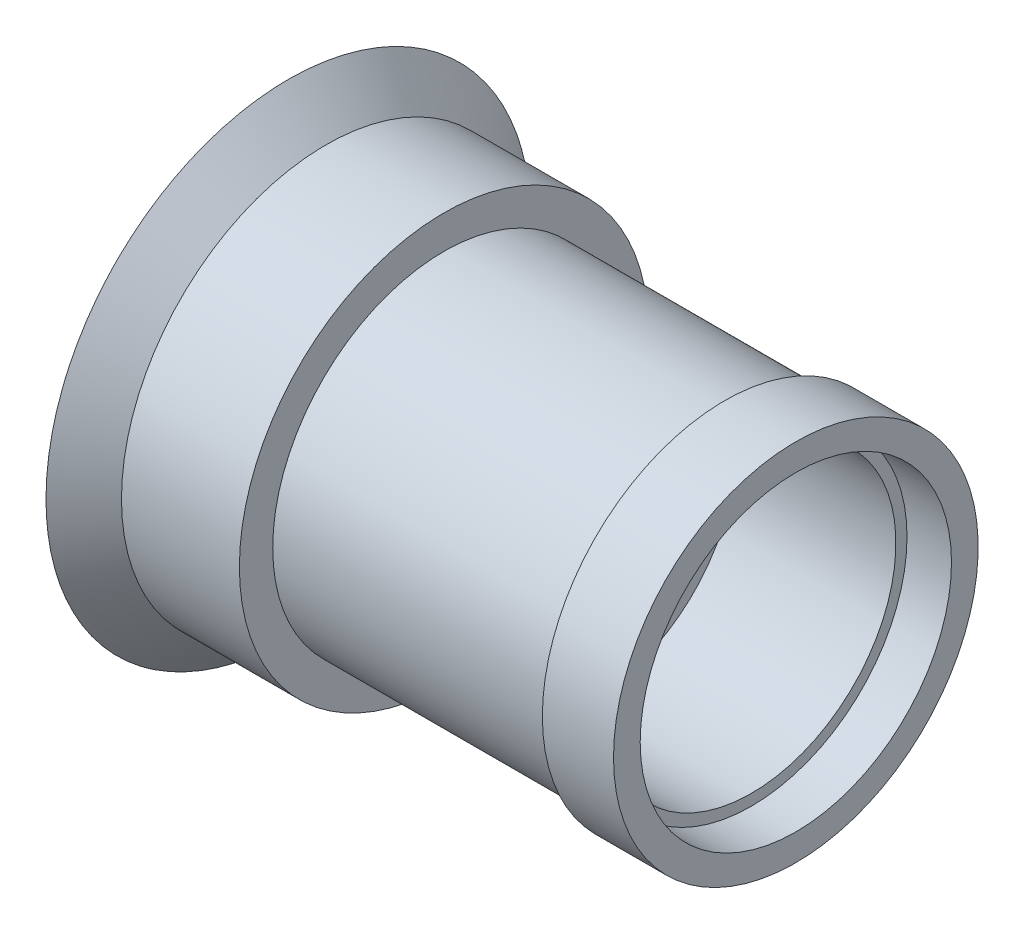
ISO-10303-21;
HEADER;
FILE_DESCRIPTION(('STEP AP214'),'2;1');
FILE_NAME('part.step','',(''),(''),'','','');
FILE_SCHEMA(('AUTOMOTIVE_DESIGN { 1 0 10303 214 1 1 1 1 }'));
ENDSEC;
DATA;
#1=APPLICATION_CONTEXT('core data for automotive mechanical design processes');
#2=APPLICATION_PROTOCOL_DEFINITION('international standard','automotive_design',2000,#1);
#3=PRODUCT_CONTEXT('',#1,'mechanical');
#4=PRODUCT('Part','Part','',(#3));
#5=PRODUCT_RELATED_PRODUCT_CATEGORY('part','',(#4));
#6=PRODUCT_DEFINITION_FORMATION('','',#4);
#7=PRODUCT_DEFINITION_CONTEXT('part definition',#1,'design');
#8=PRODUCT_DEFINITION('design','',#6,#7);
#9=PRODUCT_DEFINITION_SHAPE('','',#8);
#10=(LENGTH_UNIT() NAMED_UNIT(*) SI_UNIT(.MILLI.,.METRE.));
#11=(NAMED_UNIT(*) PLANE_ANGLE_UNIT() SI_UNIT($,.RADIAN.));
#12=(NAMED_UNIT(*) SI_UNIT($,.STERADIAN.) SOLID_ANGLE_UNIT());
#13=UNCERTAINTY_MEASURE_WITH_UNIT(LENGTH_MEASURE(1.E-05),#10,'distance_accuracy_value','');
#14=(GEOMETRIC_REPRESENTATION_CONTEXT(3) GLOBAL_UNCERTAINTY_ASSIGNED_CONTEXT((#13)) GLOBAL_UNIT_ASSIGNED_CONTEXT((#10,
#11,#12)) REPRESENTATION_CONTEXT('',''));
#15=CARTESIAN_POINT('',(0.,0.,0.));
#16=DIRECTION('',(0.,0.,1.));
#17=DIRECTION('',(1.,0.,0.));
#18=AXIS2_PLACEMENT_3D('',#15,#16,#17);
#19=CARTESIAN_POINT('',(83.5011627906982,0.,0.));
#20=DIRECTION('',(1.,0.,0.));
#21=DIRECTION('',(0.,0.,-1.));
#22=AXIS2_PLACEMENT_3D('',#19,#20,#21);
#23=PLANE('',#22);
#24=CARTESIAN_POINT('',(83.5011627906982,0.,54.4852813744042));
#25=CARTESIAN_POINT('',(83.5011627906982,0.752711586166467,54.4853126248209));
#26=CARTESIAN_POINT('',(83.5011627906982,1.50546958796749,54.4696571070647));
#27=CARTESIAN_POINT('',(83.5011627906982,3.01020278615379,54.4071516814103));
#28=CARTESIAN_POINT('',(83.5011627906982,3.7621771031544,54.3602805857962));
#29=CARTESIAN_POINT('',(83.5011627906982,4.79470749016325,54.2744759729736));
#30=CARTESIAN_POINT('',(83.5011627906982,5.07641674808145,54.2488627252482));
#31=CARTESIAN_POINT('',(83.5011627906982,5.82905260249814,54.1745440975255));
#32=CARTESIAN_POINT('',(83.5011627906982,6.2995954613315,54.1219066521543));
#33=CARTESIAN_POINT('',(83.5011627906982,7.52021601440023,53.9692022040763));
#34=CARTESIAN_POINT('',(83.5011627906982,8.26912700967418,53.8595990056953));
#35=CARTESIAN_POINT('',(83.5011627906982,9.57509867237933,53.6404487430558));
#36=CARTESIAN_POINT('',(83.5011627906982,10.1333265842053,53.5377343671021));
#37=CARTESIAN_POINT('',(83.5011627906982,11.6179817511178,53.2406411303014));
#38=CARTESIAN_POINT('',(83.5011627906982,12.5413877362342,53.0308499881373));
#39=CARTESIAN_POINT('',(83.5011627906982,14.1906076038005,52.6106927919441));
#40=CARTESIAN_POINT('',(83.5011627906982,14.9186541653331,52.4090042907183));
#41=CARTESIAN_POINT('',(83.5011627906982,16.3654124664527,51.9754590405639));
#42=CARTESIAN_POINT('',(83.5011627906982,17.0841277727001,51.7436142153251));
#43=CARTESIAN_POINT('',(83.5011627906982,18.5122414992208,51.249815669763));
#44=CARTESIAN_POINT('',(83.5011627906982,19.2216260534264,50.9878217815125));
#45=CARTESIAN_POINT('',(83.5011627906982,20.2777875004917,50.5726595353482));
#46=CARTESIAN_POINT('',(83.5011627906982,20.6288936638988,50.4304127021474));
#47=CARTESIAN_POINT('',(83.5011627906982,21.3228620846093,50.1408762647769));
#48=CARTESIAN_POINT('',(83.5011627906982,21.6657690964663,49.9936939197368));
#49=CARTESIAN_POINT('',(83.5011627906982,22.6884130770341,49.5423061784146));
#50=CARTESIAN_POINT('',(83.5011627906982,23.3635803811386,49.2276670771102));
#51=CARTESIAN_POINT('',(83.5011627906982,24.699435358487,48.5713685678997));
#52=CARTESIAN_POINT('',(83.5011627906982,25.3601423237516,48.2297483685775));
#53=CARTESIAN_POINT('',(83.5011627906982,26.6671136466096,47.5195335072086));
#54=CARTESIAN_POINT('',(83.5011627906982,27.3133742031054,47.1509318524378));
#55=CARTESIAN_POINT('',(83.5011627906982,28.591506110191,46.3867734969199));
#56=CARTESIAN_POINT('',(83.5011627906982,29.2233469823617,45.9911656926982));
#57=CARTESIAN_POINT('',(83.5011627906982,30.0029991116517,45.4806168677257));
#58=CARTESIAN_POINT('',(83.5011627906982,30.1586614805181,45.377543693573));
#59=CARTESIAN_POINT('',(83.5011627906982,30.7591620528207,44.9754960494971));
#60=CARTESIAN_POINT('',(83.5011627906982,31.2001795931828,44.6707804550283));
#61=CARTESIAN_POINT('',(83.5011627906982,32.2174493290976,43.9455016679083));
#62=CARTESIAN_POINT('',(83.5011627906982,32.7901635921899,43.5199681569628));
#63=CARTESIAN_POINT('',(83.5011627906982,33.9180006590533,42.6469384073847));
#64=CARTESIAN_POINT('',(83.5011627906982,34.4731346325906,42.1994565939622));
#65=CARTESIAN_POINT('',(83.5011627906982,35.5658360780129,41.2825562809614));
#66=CARTESIAN_POINT('',(83.5011627906982,36.1033872242416,40.8131183255527));
#67=CARTESIAN_POINT('',(83.5011627906982,37.160967804268,39.8523579768956));
#68=CARTESIAN_POINT('',(83.5011627906982,37.6809510874575,39.3609847886938));
#69=CARTESIAN_POINT('',(83.5011627906982,38.6820451462913,38.3772638260014));
#70=CARTESIAN_POINT('',(83.5011627906982,39.1638823293796,37.8856550216319));
#71=CARTESIAN_POINT('',(83.5011627906982,40.1076970437305,36.885376603349));
#72=CARTESIAN_POINT('',(83.5011627906982,40.5697084144805,36.376738931837));
#73=CARTESIAN_POINT('',(83.5011627906982,41.4739088676514,35.3424536771706));
#74=CARTESIAN_POINT('',(83.5011627906982,41.9161046988727,34.8168119919148));
#75=CARTESIAN_POINT('',(83.5011627906982,42.7807080869844,33.7485235074199));
#76=CARTESIAN_POINT('',(83.5011627906982,43.2030933521978,33.2058586465839));
#77=CARTESIAN_POINT('',(83.5011627906982,43.9246928659671,32.2417271920469));
#78=CARTESIAN_POINT('',(83.5011627906982,44.2284409564482,31.823638051822));
#79=CARTESIAN_POINT('',(83.5011627906982,45.0416423392789,30.6704587733944));
#80=CARTESIAN_POINT('',(83.5011627906982,45.5392432541133,29.9269425043231));
#81=CARTESIAN_POINT('',(83.5011627906982,46.40053076337,28.5687208523191));
#82=CARTESIAN_POINT('',(83.5011627906982,46.7709832235245,27.9582847771043));
#83=CARTESIAN_POINT('',(83.5011627906982,47.4874214987721,26.7234144237199));
#84=CARTESIAN_POINT('',(83.5011627906982,47.8334135492391,26.0989837668503));
#85=CARTESIAN_POINT('',(83.5011627906982,48.5009647302362,24.836142109474));
#86=CARTESIAN_POINT('',(83.5011627906982,48.8224915270088,24.1977139965228));
#87=CARTESIAN_POINT('',(83.5011627906982,49.2861082999566,23.2303971750398));
#88=CARTESIAN_POINT('',(83.5011627906982,49.4376760026302,22.906019286442));
#89=CARTESIAN_POINT('',(83.5011627906982,49.7407972978128,22.2404184185418));
#90=CARTESIAN_POINT('',(83.5011627906982,49.892072618408,21.8990686947503));
#91=CARTESIAN_POINT('',(83.5011627906982,50.3347214236519,20.8719680521844));
#92=CARTESIAN_POINT('',(83.5011627906982,50.6156343812782,20.1816738376577));
#93=CARTESIAN_POINT('',(83.5011627906982,51.1484074868567,18.7911564673318));
#94=CARTESIAN_POINT('',(83.5011627906982,51.4003101934032,18.0909495929744));
#95=CARTESIAN_POINT('',(83.5011627906982,51.8751203574596,16.6806278946167));
#96=CARTESIAN_POINT('',(83.5011627906982,52.098021879294,15.9705110751742));
#97=CARTESIAN_POINT('',(83.5011627906982,52.5671354308166,14.3610387782374));
#98=CARTESIAN_POINT('',(83.5011627906982,52.8049939481179,13.4592281820974));
#99=CARTESIAN_POINT('',(83.5011627906982,53.1513479216869,11.996138765908));
#100=CARTESIAN_POINT('',(83.5011627906982,53.2742706946811,11.4382180735001));
#101=CARTESIAN_POINT('',(83.5011627906982,53.5402400401858,10.1339206439888));
#102=CARTESIAN_POINT('',(83.5011627906982,53.6765282720638,9.38614901154611));
#103=CARTESIAN_POINT('',(83.5011627906982,53.9174453737444,7.88633624916249));
#104=CARTESIAN_POINT('',(83.5011627906982,54.0221069111916,7.13430034775033));
#105=CARTESIAN_POINT('',(83.5011627906982,54.1998316857519,5.62594670085116));
#106=CARTESIAN_POINT('',(83.5011627906982,54.2728719697453,4.86962624738772));
#107=CARTESIAN_POINT('',(83.5011627906982,54.3874174909036,3.35272061831796));
#108=CARTESIAN_POINT('',(83.5011627906982,54.4288440317535,2.59212951722869));
#109=CARTESIAN_POINT('',(83.5011627906982,54.4807430987387,1.05000891129991));
#110=CARTESIAN_POINT('',(83.5011627906982,54.4903793739588,0.268451110600945));
#111=CARTESIAN_POINT('',(83.5011627906982,54.4759909119227,-1.29255432498716));
#112=CARTESIAN_POINT('',(83.5011627906982,54.4520438421682,-2.07200266558481));
#113=CARTESIAN_POINT('',(83.5011627906982,54.3705681379486,-3.62877869981849));
#114=CARTESIAN_POINT('',(83.5011627906982,54.3130549371697,-4.40610720323115));
#115=CARTESIAN_POINT('',(83.5011627906982,54.1644785227371,-5.95866593889692));
#116=CARTESIAN_POINT('',(83.5011627906982,54.0733685007448,-6.73389171627238));
#117=CARTESIAN_POINT('',(83.5011627906982,53.8848025970906,-8.08802907374154));
#118=CARTESIAN_POINT('',(83.5011627906982,53.7945213498162,-8.66795720114898));
#119=CARTESIAN_POINT('',(83.5011627906982,53.526530340975,-10.2240905319902));
#120=CARTESIAN_POINT('',(83.5011627906982,53.3315002072032,-11.1973797253796));
#121=CARTESIAN_POINT('',(83.5011627906982,52.9103510472875,-13.0360503386944));
#122=CARTESIAN_POINT('',(83.5011627906982,52.6892172660893,-13.9025803404081));
#123=CARTESIAN_POINT('',(83.5011627906982,52.2618678737513,-15.4208130331149));
#124=CARTESIAN_POINT('',(83.5011627906982,52.0644260125801,-16.0750000732804));
#125=CARTESIAN_POINT('',(83.5011627906982,51.6150869635305,-17.4682408106903));
#126=CARTESIAN_POINT('',(83.5011627906982,51.3594393910205,-18.2060930940287));
#127=CARTESIAN_POINT('',(83.5011627906982,50.95225342568,-19.3044031006811));
#128=CARTESIAN_POINT('',(83.5011627906982,50.8124968860867,-19.6692744706759));
#129=CARTESIAN_POINT('',(83.5011627906982,50.5323837824902,-20.3778050625047));
#130=CARTESIAN_POINT('',(83.5011627906982,50.3924055398497,-20.7216138347415));
#131=CARTESIAN_POINT('',(83.5011627906982,49.9625757638061,-21.747307125022));
#132=CARTESIAN_POINT('',(83.5011627906982,49.6623075998197,-22.4248606659744));
#133=CARTESIAN_POINT('',(83.5011627906982,49.0346874647476,-23.766270573698));
#134=CARTESIAN_POINT('',(83.5011627906982,48.7073693364056,-24.430142795513));
#135=CARTESIAN_POINT('',(83.5011627906982,48.025701858713,-25.7442143593146));
#136=CARTESIAN_POINT('',(83.5011627906982,47.6713407159291,-26.3944075763971));
#137=CARTESIAN_POINT('',(83.5011627906982,46.8433553958586,-27.8425481589007));
#138=CARTESIAN_POINT('',(83.5011627906982,46.3622466480405,-28.6362389632953));
#139=CARTESIAN_POINT('',(83.5011627906982,45.5696284977286,-29.8721617219947));
#140=CARTESIAN_POINT('',(83.5011627906982,45.2711444170119,-30.3228189683203));
#141=CARTESIAN_POINT('',(83.5011627906982,44.5599382803068,-31.3626304616799));
#142=CARTESIAN_POINT('',(83.5011627906982,44.142084906295,-31.9482925767366));
#143=CARTESIAN_POINT('',(83.5011627906982,43.2837334493055,-33.1020869156677));
#144=CARTESIAN_POINT('',(83.5011627906982,42.8432523349066,-33.6702317785448));
#145=CARTESIAN_POINT('',(83.5011627906982,41.9396660940152,-34.7890330554238));
#146=CARTESIAN_POINT('',(83.5011627906982,41.4765422347191,-35.3396743450068));
#147=CARTESIAN_POINT('',(83.5011627906982,40.527713258847,-36.4234906019169));
#148=CARTESIAN_POINT('',(83.5011627906982,40.0419562609487,-36.9566201284995));
#149=CARTESIAN_POINT('',(83.5011627906982,39.0293628104361,-38.0249907846377));
#150=CARTESIAN_POINT('',(83.5011627906982,38.5016583232853,-38.5594095978107));
#151=CARTESIAN_POINT('',(83.5011627906982,37.4258799798332,-39.6047370686906));
#152=CARTESIAN_POINT('',(83.5011627906982,36.8778573323094,-40.1156984155373));
#153=CARTESIAN_POINT('',(83.5011627906982,35.7614879128201,-41.1141432645903));
#154=CARTESIAN_POINT('',(83.5011627906982,35.1931548948035,-41.6016421493332));
#155=CARTESIAN_POINT('',(83.5011627906982,34.0361807397315,-42.5532124926792));
#156=CARTESIAN_POINT('',(83.5011627906982,33.4475189294058,-43.0172588452906));
#157=CARTESIAN_POINT('',(83.5011627906982,32.4000924456711,-43.8085321611298));
#158=CARTESIAN_POINT('',(83.5011627906982,31.9453608527984,-44.1411251317267));
#159=CARTESIAN_POINT('',(83.5011627906982,30.6907332730291,-45.0294906732446));
#160=CARTESIAN_POINT('',(83.5011627906982,29.8808257083987,-45.5712486002382));
#161=CARTESIAN_POINT('',(83.5011627906982,28.3994666951289,-46.5055200174551));
#162=CARTESIAN_POINT('',(83.5011627906982,27.7330663604012,-46.9060853975525));
#163=CARTESIAN_POINT('',(83.5011627906982,26.3837071113181,-47.6781518525716));
#164=CARTESIAN_POINT('',(83.5011627906982,25.7007498603666,-48.0496558314495));
#165=CARTESIAN_POINT('',(83.5011627906982,24.318299983538,-48.7636428534212));
#166=CARTESIAN_POINT('',(83.5011627906982,23.6187805631801,-49.1060740811647));
#167=CARTESIAN_POINT('',(83.5011627906982,22.5582123489357,-49.5975074342925));
#168=CARTESIAN_POINT('',(83.5011627906982,22.2023557682267,-49.7578028918003));
#169=CARTESIAN_POINT('',(83.5011627906982,21.4826118017378,-50.0728473429274));
#170=CARTESIAN_POINT('',(83.5011627906982,21.118680348149,-50.2274956695985));
#171=CARTESIAN_POINT('',(83.5011627906982,20.023581897396,-50.6788673631408));
#172=CARTESIAN_POINT('',(83.5011627906982,19.2874991314865,-50.9637650574868));
#173=CARTESIAN_POINT('',(83.5011627906982,17.8046234245203,-51.5008190556213));
#174=CARTESIAN_POINT('',(83.5011627906982,17.0578462142828,-51.7530188661794));
#175=CARTESIAN_POINT('',(83.5011627906982,15.5536010342859,-52.2247249370166));
#176=CARTESIAN_POINT('',(83.5011627906982,14.7961273689579,-52.4442130006921));
#177=CARTESIAN_POINT('',(83.5011627906982,13.0790590536571,-52.9016217595523));
#178=CARTESIAN_POINT('',(83.5011627906982,12.1169240119912,-53.1300999632284));
#179=CARTESIAN_POINT('',(83.5011627906982,10.5699289244552,-53.4535540313563));
#180=CARTESIAN_POINT('',(83.5011627906982,9.98850857014402,-53.5653229575727));
#181=CARTESIAN_POINT('',(83.5011627906982,8.6276250220754,-53.8038477401191));
#182=CARTESIAN_POINT('',(83.5011627906982,7.84683275543506,-53.9231544387119));
#183=CARTESIAN_POINT('',(83.5011627906982,6.57372323880664,-54.0894484481298));
#184=CARTESIAN_POINT('',(83.5011627906982,6.08272910784552,-54.1467951420017));
#185=CARTESIAN_POINT('',(83.5011627906982,5.29739158157183,-54.2277632751061));
#186=CARTESIAN_POINT('',(83.5011627906982,5.00348415777398,-54.2556658634877));
#187=CARTESIAN_POINT('',(83.5011627906982,3.92621921118552,-54.3491390505703));
#188=CARTESIAN_POINT('',(83.5011627906982,3.14154525623414,-54.4002055971854));
#189=CARTESIAN_POINT('',(83.5011627906982,1.57124697659944,-54.4682649287003));
#190=CARTESIAN_POINT('',(83.5011627906982,0.785623558696567,-54.4852791003087));
#191=CARTESIAN_POINT('',(83.5011627906982,-0.785446973870968,-54.4852836479886));
#192=CARTESIAN_POINT('',(83.5011627906982,-1.57089408847234,-54.4682816707385));
#193=CARTESIAN_POINT('',(83.5011627906982,-3.14109628321312,-54.4002321100909));
#194=CARTESIAN_POINT('',(83.5011627906982,-3.92584998428207,-54.3491520002593));
#195=CARTESIAN_POINT('',(83.5011627906982,-5.00329158964963,-54.255675684982));
#196=CARTESIAN_POINT('',(83.5011627906982,-5.2972951439944,-54.2277692009194));
#197=CARTESIAN_POINT('',(83.5011627906982,-6.08259060074315,-54.1468161432451));
#198=CARTESIAN_POINT('',(83.5011627906982,-6.57344791067439,-54.0894928826083));
#199=CARTESIAN_POINT('',(83.5011627906982,-7.84639733433905,-53.9232247970075));
#200=CARTESIAN_POINT('',(83.5011627906982,-8.62715850359261,-53.8039068323125));
#201=CARTESIAN_POINT('',(83.5011627906982,-9.98821234806078,-53.5653759035845));
#202=CARTESIAN_POINT('',(83.5011627906982,-10.5698184348832,-53.4535959871042));
#203=CARTESIAN_POINT('',(83.5011627906982,-11.3432705516099,-53.2918532915804));
#204=CARTESIAN_POINT('',(83.5011627906982,-11.5368925622278,-53.2502623460053));
#205=CARTESIAN_POINT('',(83.5011627906982,-12.5020005063577,-53.0374953042431));
#206=CARTESIAN_POINT('',(83.5011627906982,-13.2701290306314,-52.8507218201912));
#207=CARTESIAN_POINT('',(83.5011627906982,-14.7956776769147,-52.4443771067774));
#208=CARTESIAN_POINT('',(83.5011627906982,-15.5531188157783,-52.2248844306744));
#209=CARTESIAN_POINT('',(83.5011627906982,-17.0573532775221,-51.753172092023));
#210=CARTESIAN_POINT('',(83.5011627906982,-17.8041514587349,-51.5009679298525));
#211=CARTESIAN_POINT('',(83.5011627906982,-19.2871331442796,-50.9638820172404));
#212=CARTESIAN_POINT('',(83.5011627906982,-20.0232999683943,-50.6789541184969));
#213=CARTESIAN_POINT('',(83.5011627906982,-21.1185497589011,-50.2275372355623));
#214=CARTESIAN_POINT('',(83.5011627906982,-21.4825467589805,-50.0728688299328));
#215=CARTESIAN_POINT('',(83.5011627906982,-22.2022966856867,-49.7578356435722));
#216=CARTESIAN_POINT('',(83.5011627906982,-22.5580948409449,-49.5975741883414));
#217=CARTESIAN_POINT('',(83.5011627906982,-23.618529901631,-49.1062201306109));
#218=CARTESIAN_POINT('',(83.5011627906982,-24.3179730447884,-48.763829565777));
#219=CARTESIAN_POINT('',(83.5011627906982,-25.7003247848178,-48.0498979970426));
#220=CARTESIAN_POINT('',(83.5011627906982,-26.3832589322707,-47.6784063916224));
#221=CARTESIAN_POINT('',(83.5011627906982,-27.7326369857926,-46.9063277356854));
#222=CARTESIAN_POINT('',(83.5011627906982,-28.399077871712,-46.5057354084971));
#223=CARTESIAN_POINT('',(83.5011627906982,-29.7155328351046,-45.6754797225007));
#224=CARTESIAN_POINT('',(83.5011627906982,-30.3655108751637,-45.2457590796976));
#225=CARTESIAN_POINT('',(83.5011627906982,-31.1664494045882,-44.691372090055));
#226=CARTESIAN_POINT('',(83.5011627906982,-31.3263213967117,-44.5794466928915));
#227=CARTESIAN_POINT('',(83.5011627906982,-31.9452602396782,-44.1412032788364));
#228=CARTESIAN_POINT('',(83.5011627906982,-32.3999454174428,-43.8086583831018));
#229=CARTESIAN_POINT('',(83.5011627906982,-33.4472749209884,-43.0174791827428));
#230=CARTESIAN_POINT('',(83.5011627906982,-34.0358746677129,-42.5534817093056));
#231=CARTESIAN_POINT('',(83.5011627906982,-35.1927845746406,-41.6019651032414));
#232=CARTESIAN_POINT('',(83.5011627906982,-35.761113795624,-41.1144691386449));
#233=CARTESIAN_POINT('',(83.5011627906982,-36.8775190070484,-40.1159928056314));
#234=CARTESIAN_POINT('',(83.5011627906982,-37.4255795589171,-39.604995174721));
#235=CARTESIAN_POINT('',(83.5011627906982,-38.5014855418395,-38.5595598264007));
#236=CARTESIAN_POINT('',(83.5011627906982,-39.0292780397554,-38.025067641691));
#237=CARTESIAN_POINT('',(83.5011627906982,-40.0418830214494,-36.9567094824977));
#238=CARTESIAN_POINT('',(83.5011627906982,-40.5275702107344,-36.4236721766093));
#239=CARTESIAN_POINT('',(83.5011627906982,-41.4762956647699,-35.3399910969851));
#240=CARTESIAN_POINT('',(83.5011627906982,-41.9393839985877,-34.789391174915));
#241=CARTESIAN_POINT('',(83.5011627906982,-42.8429424042078,-33.6706243665455));
#242=CARTESIAN_POINT('',(83.5011627906982,-43.2834292984457,-33.1024710652346));
#243=CARTESIAN_POINT('',(83.5011627906982,-44.1418237303763,-31.9486213756401));
#244=CARTESIAN_POINT('',(83.5011627906982,-44.559712328657,-31.3629108927184));
#245=CARTESIAN_POINT('',(83.5011627906982,-45.2710355614201,-30.322956625717));
#246=CARTESIAN_POINT('',(83.5011627906982,-45.5695923869295,-29.8722105001326));
#247=CARTESIAN_POINT('',(83.5011627906982,-45.9617387058094,-29.2607501887005));
#248=CARTESIAN_POINT('',(83.5011627906982,-46.0612628939627,-29.103818539319));
#249=CARTESIAN_POINT('',(83.5011627906982,-46.554070721612,-28.3179582982041));
#250=CARTESIAN_POINT('',(83.5011627906982,-46.9354560204471,-27.6814908639504));
#251=CARTESIAN_POINT('',(83.5011627906982,-47.6711317637623,-26.3948265495878));
#252=CARTESIAN_POINT('',(83.5011627906982,-48.0254753517183,-25.7446599796376));
#253=CARTESIAN_POINT('',(83.5011627906982,-48.7071370405616,-24.4305967321985));
#254=CARTESIAN_POINT('',(83.5011627906982,-49.0344646251051,-23.7667049759964));
#255=CARTESIAN_POINT('',(83.5011627906982,-49.6621343365294,-22.4251973041507));
#256=CARTESIAN_POINT('',(83.5011627906982,-49.9624402729737,-21.7475644296839));
#257=CARTESIAN_POINT('',(83.5011627906982,-50.3923441537279,-20.7217342214008));
#258=CARTESIAN_POINT('',(83.5011627906982,-50.5323541476536,-20.3778657268335));
#259=CARTESIAN_POINT('',(83.5011627906982,-50.8124583934938,-19.6693868748336));
#260=CARTESIAN_POINT('',(83.5011627906982,-50.9521778665032,-19.3046283560795));
#261=CARTESIAN_POINT('',(83.5011627906982,-51.3593141234318,-18.2064770032006));
#262=CARTESIAN_POINT('',(83.5011627906982,-51.6149369360397,-17.4686657465639));
#263=CARTESIAN_POINT('',(83.5011627906982,-52.0643214806324,-16.075316403338));
#264=CARTESIAN_POINT('',(83.5011627906982,-52.2618226241544,-15.4209758228373));
#265=CARTESIAN_POINT('',(83.5011627906982,-52.6891685193106,-13.9027508632156));
#266=CARTESIAN_POINT('',(83.5011627906982,-52.9102483428874,-13.0363808838405));
#267=CARTESIAN_POINT('',(83.5011627906982,-53.2871186650306,-11.3912592820961));
#268=CARTESIAN_POINT('',(83.5011627906982,-53.4474460079393,-10.6135464379914));
#269=CARTESIAN_POINT('',(83.5011627906982,-53.6264779614476,-9.63747565515213));
#270=CARTESIAN_POINT('',(83.5011627906982,-53.6612283418626,-9.44198868270856));
#271=CARTESIAN_POINT('',(83.5011627906982,-53.7944772184761,-8.6680835034193));
#272=CARTESIAN_POINT('',(83.5011627906982,-53.8847791782625,-8.08822932841126));
#273=CARTESIAN_POINT('',(83.5011627906982,-54.0733628346521,-6.73423741522367));
#274=CARTESIAN_POINT('',(83.5011627906982,-54.1644550065791,-5.95909191401507));
#275=CARTESIAN_POINT('',(83.5011627906982,-54.3130178240696,-4.40661912969081));
#276=CARTESIAN_POINT('',(83.5011627906982,-54.3705325300227,-3.62929605672753));
#277=CARTESIAN_POINT('',(83.5011627906982,-54.4520129085819,-2.07247063574752));
#278=CARTESIAN_POINT('',(83.5011627906982,-54.4759604018129,-1.29296733575253));
#279=CARTESIAN_POINT('',(83.5011627906982,-54.4903628441814,0.268212326489556));
#280=CARTESIAN_POINT('',(83.5011627906982,-54.4807374299387,1.04988942144204));
#281=CARTESIAN_POINT('',(83.5011627906982,-54.4288573668269,2.59201380213456));
#282=CARTESIAN_POINT('',(83.5011627906982,-54.3874488755667,3.35248970007665));
#283=CARTESIAN_POINT('',(83.5011627906982,-54.2729291182372,4.86922557666516));
#284=CARTESIAN_POINT('',(83.5011627906982,-54.1998939942518,5.62549128990538));
#285=CARTESIAN_POINT('',(83.5011627906982,-54.0221740333683,7.13380068220878));
#286=CARTESIAN_POINT('',(83.5011627906982,-53.9175095577642,7.88584676134905));
#287=CARTESIAN_POINT('',(83.5011627906982,-53.6765847292125,9.38572924110733));
#288=CARTESIAN_POINT('',(83.5011627906982,-53.5402891405326,10.1335599873449));
#289=CARTESIAN_POINT('',(83.5011627906982,-53.2742910173802,11.438043028476));
#290=CARTESIAN_POINT('',(83.5011627906982,-53.151347520293,11.996079425172));
#291=CARTESIAN_POINT('',(83.5011627906982,-52.9767420328603,12.7337394763765));
#292=CARTESIAN_POINT('',(83.5011627906982,-52.9328092262195,12.9152169245722));
#293=CARTESIAN_POINT('',(83.5011627906982,-52.7088610053457,13.82004210514));
#294=CARTESIAN_POINT('',(83.5011627906982,-52.5149849771644,14.5400283041401));
#295=CARTESIAN_POINT('',(83.5011627906982,-52.0981654094707,15.9700871062441));
#296=CARTESIAN_POINT('',(83.5011627906982,-51.8752751467414,16.6801753014332));
#297=CARTESIAN_POINT('',(83.5011627906982,-51.400470143701,18.0904883208243));
#298=CARTESIAN_POINT('',(83.5011627906982,-51.1485589625661,18.7907143427445));
#299=CARTESIAN_POINT('',(83.5011627906982,-50.61575077453,20.1813306893416));
#300=CARTESIAN_POINT('',(83.5011627906982,-50.3348088789978,20.8717038452098));
#301=CARTESIAN_POINT('',(83.5011627906982,-49.8921146124888,21.8989463364462));
#302=CARTESIAN_POINT('',(83.5011627906982,-49.7408188983329,22.2403574731186));
#303=CARTESIAN_POINT('',(83.5011627906982,-49.4377075525882,22.9059629635324));
#304=CARTESIAN_POINT('',(83.5011627906982,-49.2861725319781,23.2302851204682));
#305=CARTESIAN_POINT('',(83.5011627906982,-48.8226318562428,24.1974748539012));
#306=CARTESIAN_POINT('',(83.5011627906982,-48.5011445065922,24.8358301891704));
#307=CARTESIAN_POINT('',(83.5011627906982,-47.8336464570109,26.0985784121403));
#308=CARTESIAN_POINT('',(83.5011627906982,-47.4876659794269,26.7229872982584));
#309=CARTESIAN_POINT('',(83.5011627906982,-46.7712171359318,27.9578749618363));
#310=CARTESIAN_POINT('',(83.5011627906982,-46.4007404602729,28.5683489167537));
#311=CARTESIAN_POINT('',(83.5011627906982,-45.6353147877944,29.7754145012497));
#312=CARTESIAN_POINT('',(83.5011627906982,-45.2403207623229,30.3719776428318));
#313=CARTESIAN_POINT('',(83.5011627906982,-44.732038041356,31.1079719052202));
#314=CARTESIAN_POINT('',(83.5011627906982,-44.6295018733459,31.2549002078465));
#315=CARTESIAN_POINT('',(83.5011627906982,-44.2285154504991,31.8235439819696));
#316=CARTESIAN_POINT('',(83.5011627906982,-43.9248172075796,32.2415797835688));
#317=CARTESIAN_POINT('',(83.5011627906982,-43.2033131874212,33.2056061582257));
#318=CARTESIAN_POINT('',(83.5011627906982,-42.7809756622729,33.7482103446802));
#319=CARTESIAN_POINT('',(83.5011627906982,-41.9164250032449,34.8164351438961));
#320=CARTESIAN_POINT('',(83.5011627906982,-41.4742323558048,35.3420723421833));
#321=CARTESIAN_POINT('',(83.5011627906982,-40.5700008359836,36.3763936472323));
#322=CARTESIAN_POINT('',(83.5011627906982,-40.1079534575154,36.8850703187093));
#323=CARTESIAN_POINT('',(83.5011627906982,-39.1640314314874,37.8854788677951));
#324=CARTESIAN_POINT('',(83.5011627906982,-38.6821212687244,38.3771772236663));
#325=CARTESIAN_POINT('',(83.5011627906982,-37.6810383317166,39.3609113190337));
#326=CARTESIAN_POINT('',(83.5011627906982,-37.1611452850912,39.8522143492632));
#327=CARTESIAN_POINT('',(83.5011627906982,-36.1036963499435,40.8128711417907));
#328=CARTESIAN_POINT('',(83.5011627906982,-35.5661850312868,41.2822739582045));
#329=CARTESIAN_POINT('',(83.5011627906982,-34.4735185437471,42.1991451043977));
#330=CARTESIAN_POINT('',(83.5011627906982,-33.9183781592006,42.6466310533628));
#331=CARTESIAN_POINT('',(83.5011627906982,-32.7904820456683,43.5197085841566));
#332=CARTESIAN_POINT('',(83.5011627906982,-32.2177136803769,43.9452838467452));
#333=CARTESIAN_POINT('',(83.5011627906982,-31.2003210143637,44.6706648122268));
#334=CARTESIAN_POINT('',(83.5011627906982,-30.7592329537569,44.9754383752858));
#335=CARTESIAN_POINT('',(83.5011627906982,-30.1586914020393,45.3775272138049));
#336=CARTESIAN_POINT('',(83.5011627906982,-30.0030592799126,45.4805844305465));
#337=CARTESIAN_POINT('',(83.5011627906982,-29.2235261997096,45.9910731139814));
#338=CARTESIAN_POINT('',(83.5011627906982,-28.5917711892244,46.3866326543435));
#339=CARTESIAN_POINT('',(83.5011627906982,-27.313759280835,47.1507258981923));
#340=CARTESIAN_POINT('',(83.5011627906982,-26.6675315920639,47.5193085770701));
#341=CARTESIAN_POINT('',(83.5011627906982,-25.360573752063,48.2295164720688));
#342=CARTESIAN_POINT('',(83.5011627906982,-24.699846208271,48.5711464849991));
#343=CARTESIAN_POINT('',(83.5011627906982,-23.3638975013069,49.2274948421995));
#344=CARTESIAN_POINT('',(83.5011627906982,-22.6886559484761,49.5421717467101));
#345=CARTESIAN_POINT('',(83.5011627906982,-21.66588276653,49.9936326205855));
#346=CARTESIAN_POINT('',(83.5011627906982,-21.3229191977356,50.1408462326412));
#347=CARTESIAN_POINT('',(83.5011627906982,-20.6289562322647,50.4303928929865));
#348=CARTESIAN_POINT('',(83.5011627906982,-20.2779131035187,50.5726211355723));
#349=CARTESIAN_POINT('',(83.5011627906982,-19.2218966500251,50.9877426063854));
#350=CARTESIAN_POINT('',(83.5011627906982,-18.5125920140064,51.2497107685399));
#351=CARTESIAN_POINT('',(83.5011627906982,-17.0845824761538,51.743475027849));
#352=CARTESIAN_POINT('',(83.5011627906982,-16.3658905997618,51.9753088709762));
#353=CARTESIAN_POINT('',(83.5011627906982,-14.9191131877945,52.4088673102217));
#354=CARTESIAN_POINT('',(83.5011627906982,-14.191023342543,52.6105775178659));
#355=CARTESIAN_POINT('',(83.5011627906982,-12.7254235330702,52.9839344380161));
#356=CARTESIAN_POINT('',(83.5011627906982,-11.9878962739663,53.15551356279));
#357=CARTESIAN_POINT('',(83.5011627906982,-11.0616275517903,53.3509447867829));
#358=CARTESIAN_POINT('',(83.5011627906982,-10.8758413422418,53.3891407367235));
#359=CARTESIAN_POINT('',(83.5011627906982,-10.1335132590901,53.5377255991425));
#360=CARTESIAN_POINT('',(83.5011627906982,-9.57540684378711,53.6404088949291));
#361=CARTESIAN_POINT('',(83.5011627906982,-8.26954216133362,53.8595330474312));
#362=CARTESIAN_POINT('',(83.5011627906982,-7.52062706129592,53.969135926547));
#363=CARTESIAN_POINT('',(83.5011627906982,-6.29986358258909,54.1218668906478));
#364=CARTESIAN_POINT('',(83.5011627906982,-5.82918612364525,54.1745236193371));
#365=CARTESIAN_POINT('',(83.5011627906982,-5.07637089679089,54.2488716101279));
#366=CARTESIAN_POINT('',(83.5011627906982,-4.79461622399078,54.2744946951572));
#367=CARTESIAN_POINT('',(83.5011627906982,-3.76200315471702,54.3603234094998));
#368=CARTESIAN_POINT('',(83.5011627906982,-3.0099904955127,54.4072041014657));
#369=CARTESIAN_POINT('',(83.5011627906982,-1.50530221074795,54.4696994144821));
#370=CARTESIAN_POINT('',(83.5011627906982,-0.752627675541876,54.4853403119457));
#371=CARTESIAN_POINT('',(83.5011627906982,0.,54.4852813744042));
#372=B_SPLINE_CURVE_WITH_KNOTS('',3,(#24,#25,#26,#27,#28,#29,#30,#31,#32,#33,#34,#35,#36,#37,
#38,#39,#40,#41,#42,#43,#44,#45,#46,#47,#48,#49,#50,#51,#52,#53,#54,#55,#56,#57,#58,#59,#60,#61,
#62,#63,#64,#65,#66,#67,#68,#69,#70,#71,#72,#73,#74,#75,#76,#77,#78,#79,#80,#81,#82,#83,#84,#85,
#86,#87,#88,#89,#90,#91,#92,#93,#94,#95,#96,#97,#98,#99,#100,#101,#102,#103,#104,#105,#106,#107,
#108,#109,#110,#111,#112,#113,#114,#115,#116,#117,#118,#119,#120,#121,#122,#123,#124,#125,#126,
#127,#128,#129,#130,#131,#132,#133,#134,#135,#136,#137,#138,#139,#140,#141,#142,#143,#144,#145,
#146,#147,#148,#149,#150,#151,#152,#153,#154,#155,#156,#157,#158,#159,#160,#161,#162,#163,#164,
#165,#166,#167,#168,#169,#170,#171,#172,#173,#174,#175,#176,#177,#178,#179,#180,#181,#182,#183,
#184,#185,#186,#187,#188,#189,#190,#191,#192,#193,#194,#195,#196,#197,#198,#199,#200,#201,#202,
#203,#204,#205,#206,#207,#208,#209,#210,#211,#212,#213,#214,#215,#216,#217,#218,#219,#220,#221,
#222,#223,#224,#225,#226,#227,#228,#229,#230,#231,#232,#233,#234,#235,#236,#237,#238,#239,#240,
#241,#242,#243,#244,#245,#246,#247,#248,#249,#250,#251,#252,#253,#254,#255,#256,#257,#258,#259,
#260,#261,#262,#263,#264,#265,#266,#267,#268,#269,#270,#271,#272,#273,#274,#275,#276,#277,#278,
#279,#280,#281,#282,#283,#284,#285,#286,#287,#288,#289,#290,#291,#292,#293,#294,#295,#296,#297,
#298,#299,#300,#301,#302,#303,#304,#305,#306,#307,#308,#309,#310,#311,#312,#313,#314,#315,#316,
#317,#318,#319,#320,#321,#322,#323,#324,#325,#326,#327,#328,#329,#330,#331,#332,#333,#334,#335,
#336,#337,#338,#339,#340,#341,#342,#343,#344,#345,#346,#347,#348,#349,#350,#351,#352,#353,#354,
#355,#356,#357,#358,#359,#360,#361,#362,#363,#364,#365,#366,#367,#368,#369,#370,#371),
.UNSPECIFIED.,.F.,.F.,(4,2,2,2,2,2,2,2,2,2,2,2,2,2,2,2,2,2,2,2,2,2,2,2,2,2,2,2,2,2,2,2,2,2,2,2,
2,2,2,2,2,2,2,2,2,2,2,2,2,2,2,2,2,2,2,2,2,2,2,2,2,2,2,2,2,2,2,2,2,2,2,2,2,2,2,2,2,2,2,2,2,2,2,2,
2,2,2,2,2,2,2,2,2,2,2,2,2,2,2,2,2,2,2,2,2,2,2,2,2,2,2,2,2,2,2,2,2,2,2,2,2,2,2,2,2,2,2,2,2,2,2,2,
2,2,2,2,2,2,2,2,2,2,2,2,2,2,2,2,2,2,2,2,2,2,2,2,2,2,2,2,2,2,2,2,2,2,2,2,2,2,2,2,2,4),(0.,
2.25806708716593,4.51766841184368,5.36625819300675,6.78654113410517,9.05645665493606,
10.7590375251186,13.5984179552195,15.8642068424589,18.1291025538245,20.3970515307296,
21.533461522465,22.6528727508383,24.886839362069,27.1176173109529,29.3489754666663,
31.5846797641124,32.1447607834457,33.7526590119506,35.8925896993813,38.0311323165002,
40.1716072404024,42.3173258777987,44.3819342629443,46.4428658290667,48.5030900613275,
50.5655795000589,52.1157564038818,54.7985384320256,56.9401708295685,59.0812553052466,
61.2251220273209,62.2991878413773,63.4192253441787,65.6543390437986,67.8861308551431,
70.1183787313969,72.9149701845815,74.6286501252841,76.9082067883746,79.1854007538597,
81.464244920355,83.748743490375,86.0928765069438,88.4315972272288,90.7692434514272,
93.1101589529827,94.8706532245065,97.8469482677772,100.528762876997,102.578324040591,
104.92016598095,106.092253921114,107.205823665038,109.4284787434,111.648393933885,
113.869282821177,116.652303322186,118.273739109296,120.4314659208,122.587597621177,
124.745544357862,126.90870769429,129.161218544562,131.408393966929,133.654075438546,
135.902112095231,137.592046545716,140.513678645366,142.845578145866,145.177244333207,
147.512982552616,148.683785056384,149.869985083012,152.237059766031,154.60095184504,
156.966154020141,159.931198959875,161.707150454205,164.075861795102,165.558685704337,
166.444346328647,168.802529924814,171.15923199049,173.515404339587,175.873828799686,
176.759778216418,178.242180971505,180.610844145782,182.387264970682,182.981377581828,
185.352061432269,187.717142703097,190.081107343841,192.448447651859,193.634852428997,
194.80545331024,197.140929966987,199.472524700334,201.804543269125,204.141289089287,
204.726757861641,206.416419081777,208.664250314496,210.909908933951,213.15724423845,
215.4100969318,217.572914179155,219.730699083122,221.886853912485,224.044788646125,
225.666501027075,226.223987032652,228.449248945925,230.670018610159,232.890005353434,
235.112922423159,236.226694181103,237.398426160189,239.740125607893,241.790185239016,
244.471456866837,246.85282227861,247.448473228394,249.208681904436,251.549382651578,
253.887004984469,256.225892841408,258.570383126307,260.854533039059,263.133214101256,
265.410431383353,267.690197670478,269.404156446302,269.964312408186,272.200495871853,
274.432629632747,276.664489931691,278.899854395398,280.020085250667,281.093958163351,
283.237574748449,285.378590915135,287.5203371338,289.666140475527,290.203645687129,
291.753546850723,293.815829078266,295.876030266395,297.937123053556,300.002076227651,
302.147453538115,304.28776882862,306.426334264999,308.566470137549,310.174641380279,
310.734620308342,312.970029083156,315.201273365553,317.432119649805,319.666336443049,
320.785940561143,321.922154512018,324.189849214969,326.454675474832,328.720580086546,
330.991504222632,331.56051721819,333.262648443255,335.532610108053,336.953296541598,
337.802025132332,340.061741736138,342.319556845535),.UNSPECIFIED.);
#373=CARTESIAN_POINT('',(83.5011627906982,0.,54.4852813744042));
#374=VERTEX_POINT('',#373);
#375=EDGE_CURVE('E10',#374,#374,#372,.T.);
#376=ORIENTED_EDGE('',*,*,#375,.T.);
#377=EDGE_LOOP('',(#376));
#378=FACE_BOUND('',#377,.T.);
#379=CARTESIAN_POINT('',(83.5011627906982,0.,0.));
#380=DIRECTION('',(-1.,0.,0.));
#381=DIRECTION('',(0.,0.,1.));
#382=AXIS2_PLACEMENT_3D('',#379,#380,#381);
#383=CIRCLE('',#382,46.0000000001642);
#384=CARTESIAN_POINT('',(83.5011627906982,0.,46.0000000001642));
#385=VERTEX_POINT('',#384);
#386=EDGE_CURVE('E108',#385,#385,#383,.T.);
#387=ORIENTED_EDGE('',*,*,#386,.F.);
#388=EDGE_LOOP('',(#387));
#389=FACE_BOUND('',#388,.T.);
#390=ADVANCED_FACE('F33',(#378,#389),#23,.F.);
#391=CARTESIAN_POINT('',(187.631162790698,0.,32.5));
#392=DIRECTION('',(1.,0.,0.));
#393=DIRECTION('',(0.,0.,-1.));
#394=AXIS2_PLACEMENT_3D('',#391,#392,#393);
#395=PLANE('',#394);
#396=CARTESIAN_POINT('',(187.631162790698,0.,0.));
#397=DIRECTION('',(-1.,0.,0.));
#398=DIRECTION('',(0.,0.,1.));
#399=AXIS2_PLACEMENT_3D('',#396,#397,#398);
#400=CIRCLE('',#399,32.5);
#401=CARTESIAN_POINT('',(187.631162790698,0.,32.5));
#402=VERTEX_POINT('',#401);
#403=EDGE_CURVE('E136',#402,#402,#400,.T.);
#404=ORIENTED_EDGE('',*,*,#403,.T.);
#405=EDGE_LOOP('',(#404));
#406=FACE_BOUND('',#405,.T.);
#407=CARTESIAN_POINT('',(187.631162790698,0.,0.));
#408=DIRECTION('',(-1.,0.,0.));
#409=DIRECTION('',(0.,0.,1.));
#410=AXIS2_PLACEMENT_3D('',#407,#408,#409);
#411=CIRCLE('',#410,35.);
#412=CARTESIAN_POINT('',(187.631162790698,0.,35.));
#413=VERTEX_POINT('',#412);
#414=EDGE_CURVE('E133',#413,#413,#411,.T.);
#415=ORIENTED_EDGE('',*,*,#414,.F.);
#416=EDGE_LOOP('',(#415));
#417=FACE_BOUND('',#416,.T.);
#418=ADVANCED_FACE('F89',(#406,#417),#395,.T.);
#419=CARTESIAN_POINT('',(-563.720958534293,0.,0.));
#420=DIRECTION('',(-1.,0.,0.));
#421=DIRECTION('',(0.,0.,1.));
#422=AXIS2_PLACEMENT_3D('',#419,#420,#421);
#423=CYLINDRICAL_SURFACE('',#422,35.);
#424=ORIENTED_EDGE('',*,*,#414,.T.);
#425=EDGE_LOOP('',(#424));
#426=FACE_BOUND('',#425,.T.);
#427=CARTESIAN_POINT('',(197.631162790698,0.,0.));
#428=DIRECTION('',(-1.,0.,0.));
#429=DIRECTION('',(0.,0.,1.));
#430=AXIS2_PLACEMENT_3D('',#427,#428,#429);
#431=CIRCLE('',#430,35.);
#432=CARTESIAN_POINT('',(197.631162790698,0.,35.));
#433=VERTEX_POINT('',#432);
#434=EDGE_CURVE('E130',#433,#433,#431,.T.);
#435=ORIENTED_EDGE('',*,*,#434,.F.);
#436=EDGE_LOOP('',(#435));
#437=FACE_BOUND('',#436,.T.);
#438=ADVANCED_FACE('F93',(#426,#437),#423,.F.);
#439=CARTESIAN_POINT('',(197.631162790698,0.,35.));
#440=DIRECTION('',(1.,0.,0.));
#441=DIRECTION('',(0.,0.,-1.));
#442=AXIS2_PLACEMENT_3D('',#439,#440,#441);
#443=PLANE('',#442);
#444=ORIENTED_EDGE('',*,*,#434,.T.);
#445=EDGE_LOOP('',(#444));
#446=FACE_BOUND('',#445,.T.);
#447=CARTESIAN_POINT('',(197.631162790698,0.,0.));
#448=DIRECTION('',(-1.,0.,0.));
#449=DIRECTION('',(0.,0.,1.));
#450=AXIS2_PLACEMENT_3D('',#447,#448,#449);
#451=CIRCLE('',#450,41.);
#452=CARTESIAN_POINT('',(197.631162790698,0.,41.));
#453=VERTEX_POINT('',#452);
#454=EDGE_CURVE('E127',#453,#453,#451,.T.);
#455=ORIENTED_EDGE('',*,*,#454,.F.);
#456=EDGE_LOOP('',(#455));
#457=FACE_BOUND('',#456,.T.);
#458=ADVANCED_FACE('F181',(#446,#457),#443,.T.);
#459=CARTESIAN_POINT('',(-563.720958534293,0.,0.));
#460=DIRECTION('',(-1.,0.,0.));
#461=DIRECTION('',(0.,0.,1.));
#462=AXIS2_PLACEMENT_3D('',#459,#460,#461);
#463=CYLINDRICAL_SURFACE('',#462,41.);
#464=ORIENTED_EDGE('',*,*,#454,.T.);
#465=EDGE_LOOP('',(#464));
#466=FACE_BOUND('',#465,.T.);
#467=CARTESIAN_POINT('',(181.631162790698,0.,0.));
#468=DIRECTION('',(-1.,0.,0.));
#469=DIRECTION('',(0.,0.,1.));
#470=AXIS2_PLACEMENT_3D('',#467,#468,#469);
#471=CIRCLE('',#470,41.);
#472=CARTESIAN_POINT('',(181.631162790698,0.,41.));
#473=VERTEX_POINT('',#472);
#474=EDGE_CURVE('E122',#473,#473,#471,.T.);
#475=ORIENTED_EDGE('',*,*,#474,.F.);
#476=EDGE_LOOP('',(#475));
#477=FACE_BOUND('',#476,.T.);
#478=ADVANCED_FACE('F185',(#466,#477),#463,.T.);
#479=CARTESIAN_POINT('',(181.631162790698,0.,38.5));
#480=DIRECTION('',(-1.,0.,0.));
#481=DIRECTION('',(0.,0.,1.));
#482=AXIS2_PLACEMENT_3D('',#479,#480,#481);
#483=PLANE('',#482);
#484=ORIENTED_EDGE('',*,*,#474,.T.);
#485=EDGE_LOOP('',(#484));
#486=FACE_BOUND('',#485,.T.);
#487=CARTESIAN_POINT('',(181.631162790698,0.,0.));
#488=DIRECTION('',(-1.,0.,0.));
#489=DIRECTION('',(0.,0.,1.));
#490=AXIS2_PLACEMENT_3D('',#487,#488,#489);
#491=CIRCLE('',#490,38.5);
#492=CARTESIAN_POINT('',(181.631162790698,0.,38.5));
#493=VERTEX_POINT('',#492);
#494=EDGE_CURVE('E118',#493,#493,#491,.T.);
#495=ORIENTED_EDGE('',*,*,#494,.F.);
#496=EDGE_LOOP('',(#495));
#497=FACE_BOUND('',#496,.T.);
#498=ADVANCED_FACE('F83',(#486,#497),#483,.T.);
#499=CARTESIAN_POINT('',(-563.720958534293,0.,0.));
#500=DIRECTION('',(-1.,0.,0.));
#501=DIRECTION('',(0.,0.,1.));
#502=AXIS2_PLACEMENT_3D('',#499,#500,#501);
#503=CYLINDRICAL_SURFACE('',#502,38.5);
#504=ORIENTED_EDGE('',*,*,#494,.T.);
#505=EDGE_LOOP('',(#504));
#506=FACE_BOUND('',#505,.T.);
#507=CARTESIAN_POINT('',(118.501162790698,0.,0.));
#508=DIRECTION('',(-1.,0.,0.));
#509=DIRECTION('',(0.,0.,1.));
#510=AXIS2_PLACEMENT_3D('',#507,#508,#509);
#511=CIRCLE('',#510,38.5);
#512=CARTESIAN_POINT('',(118.501162790698,0.,38.5));
#513=VERTEX_POINT('',#512);
#514=EDGE_CURVE('E117',#513,#513,#511,.T.);
#515=ORIENTED_EDGE('',*,*,#514,.F.);
#516=EDGE_LOOP('',(#515));
#517=FACE_BOUND('',#516,.T.);
#518=ADVANCED_FACE('F78',(#506,#517),#503,.T.);
#519=CARTESIAN_POINT('',(118.501162790698,0.,46.0000000001657));
#520=DIRECTION('',(1.,0.,0.));
#521=DIRECTION('',(0.,0.,-1.));
#522=AXIS2_PLACEMENT_3D('',#519,#520,#521);
#523=PLANE('',#522);
#524=ORIENTED_EDGE('',*,*,#514,.T.);
#525=EDGE_LOOP('',(#524));
#526=FACE_BOUND('',#525,.T.);
#527=CARTESIAN_POINT('',(118.501162790699,0.,0.));
#528=DIRECTION('',(-1.,0.,0.));
#529=DIRECTION('',(0.,0.,1.));
#530=AXIS2_PLACEMENT_3D('',#527,#528,#529);
#531=CIRCLE('',#530,46.0000000001657);
#532=CARTESIAN_POINT('',(118.501162790699,0.,46.0000000001657));
#533=VERTEX_POINT('',#532);
#534=EDGE_CURVE('E42',#533,#533,#531,.T.);
#535=ORIENTED_EDGE('',*,*,#534,.F.);
#536=EDGE_LOOP('',(#535));
#537=FACE_BOUND('',#536,.T.);
#538=ADVANCED_FACE('F76',(#526,#537),#523,.T.);
#539=CARTESIAN_POINT('',(-563.720958534293,0.,0.));
#540=DIRECTION('',(-1.,0.,0.));
#541=DIRECTION('',(0.,0.,1.));
#542=AXIS2_PLACEMENT_3D('',#539,#540,#541);
#543=CYLINDRICAL_SURFACE('',#542,46.0000000001657);
#544=ORIENTED_EDGE('',*,*,#534,.T.);
#545=EDGE_LOOP('',(#544));
#546=FACE_BOUND('',#545,.T.);
#547=CARTESIAN_POINT('',(91.9864441649367,0.,0.));
#548=DIRECTION('',(-1.,0.,0.));
#549=DIRECTION('',(0.,0.,1.));
#550=AXIS2_PLACEMENT_3D('',#547,#548,#549);
#551=CIRCLE('',#550,46.0000000001657);
#552=CARTESIAN_POINT('',(91.9864441649367,0.,46.0000000001657));
#553=VERTEX_POINT('',#552);
#554=EDGE_CURVE('E46',#553,#553,#551,.T.);
#555=ORIENTED_EDGE('',*,*,#554,.F.);
#556=EDGE_LOOP('',(#555));
#557=FACE_BOUND('',#556,.T.);
#558=ADVANCED_FACE('F71',(#546,#557),#543,.T.);
#559=CARTESIAN_POINT('',(83.5011627906982,0.,0.));
#560=DIRECTION('',(-1.,0.,0.));
#561=DIRECTION('',(0.,0.,1.));
#562=AXIS2_PLACEMENT_3D('',#559,#560,#561);
#563=CONICAL_SURFACE('',#562,54.4852813744042,0.785398163397451);
#564=ORIENTED_EDGE('',*,*,#554,.T.);
#565=EDGE_LOOP('',(#564));
#566=FACE_BOUND('',#565,.T.);
#567=ORIENTED_EDGE('',*,*,#375,.F.);
#568=EDGE_LOOP('',(#567));
#569=FACE_BOUND('',#568,.T.);
#570=ADVANCED_FACE('F60',(#566,#569),#563,.T.);
#571=CARTESIAN_POINT('',(-563.720958534293,0.,0.));
#572=DIRECTION('',(-1.,0.,0.));
#573=DIRECTION('',(0.,0.,1.));
#574=AXIS2_PLACEMENT_3D('',#571,#572,#573);
#575=CYLINDRICAL_SURFACE('',#574,32.5);
#576=CARTESIAN_POINT('',(151.631162790698,0.,0.));
#577=DIRECTION('',(-1.,0.,0.));
#578=DIRECTION('',(0.,0.,1.));
#579=AXIS2_PLACEMENT_3D('',#576,#577,#578);
#580=CIRCLE('',#579,32.5);
#581=CARTESIAN_POINT('',(151.631162790698,0.,32.5));
#582=VERTEX_POINT('',#581);
#583=EDGE_CURVE('E139',#582,#582,#580,.T.);
#584=ORIENTED_EDGE('',*,*,#583,.T.);
#585=EDGE_LOOP('',(#584));
#586=FACE_BOUND('',#585,.T.);
#587=ORIENTED_EDGE('',*,*,#403,.F.);
#588=EDGE_LOOP('',(#587));
#589=FACE_BOUND('',#588,.T.);
#590=ADVANCED_FACE('F70',(#586,#589),#575,.F.);
#591=CARTESIAN_POINT('',(151.631162790698,0.,26.));
#592=DIRECTION('',(1.,0.,0.));
#593=DIRECTION('',(0.,0.,-1.));
#594=AXIS2_PLACEMENT_3D('',#591,#592,#593);
#595=PLANE('',#594);
#596=CARTESIAN_POINT('',(151.631162790698,0.,0.));
#597=DIRECTION('',(-1.,0.,0.));
#598=DIRECTION('',(0.,0.,1.));
#599=AXIS2_PLACEMENT_3D('',#596,#597,#598);
#600=CIRCLE('',#599,26.);
#601=CARTESIAN_POINT('',(151.631162790698,0.,26.));
#602=VERTEX_POINT('',#601);
#603=EDGE_CURVE('E142',#602,#602,#600,.T.);
#604=ORIENTED_EDGE('',*,*,#603,.T.);
#605=EDGE_LOOP('',(#604));
#606=FACE_BOUND('',#605,.T.);
#607=ORIENTED_EDGE('',*,*,#583,.F.);
#608=EDGE_LOOP('',(#607));
#609=FACE_BOUND('',#608,.T.);
#610=ADVANCED_FACE('F171',(#606,#609),#595,.T.);
#611=CARTESIAN_POINT('',(-563.720958534293,0.,0.));
#612=DIRECTION('',(-1.,0.,0.));
#613=DIRECTION('',(0.,0.,1.));
#614=AXIS2_PLACEMENT_3D('',#611,#612,#613);
#615=CYLINDRICAL_SURFACE('',#614,26.);
#616=CARTESIAN_POINT('',(142.631162790698,0.,0.));
#617=DIRECTION('',(-1.,0.,0.));
#618=DIRECTION('',(0.,0.,1.));
#619=AXIS2_PLACEMENT_3D('',#616,#617,#618);
#620=CIRCLE('',#619,26.);
#621=CARTESIAN_POINT('',(142.631162790698,0.,26.));
#622=VERTEX_POINT('',#621);
#623=EDGE_CURVE('E145',#622,#622,#620,.T.);
#624=ORIENTED_EDGE('',*,*,#623,.T.);
#625=EDGE_LOOP('',(#624));
#626=FACE_BOUND('',#625,.T.);
#627=ORIENTED_EDGE('',*,*,#603,.F.);
#628=EDGE_LOOP('',(#627));
#629=FACE_BOUND('',#628,.T.);
#630=ADVANCED_FACE('F167',(#626,#629),#615,.F.);
#631=CARTESIAN_POINT('',(142.631162790698,0.,32.5));
#632=DIRECTION('',(-1.,0.,0.));
#633=DIRECTION('',(0.,0.,1.));
#634=AXIS2_PLACEMENT_3D('',#631,#632,#633);
#635=PLANE('',#634);
#636=CARTESIAN_POINT('',(142.631162790698,0.,0.));
#637=DIRECTION('',(-1.,0.,0.));
#638=DIRECTION('',(0.,0.,1.));
#639=AXIS2_PLACEMENT_3D('',#636,#637,#638);
#640=CIRCLE('',#639,32.5);
#641=CARTESIAN_POINT('',(142.631162790698,0.,32.5));
#642=VERTEX_POINT('',#641);
#643=EDGE_CURVE('E148',#642,#642,#640,.T.);
#644=ORIENTED_EDGE('',*,*,#643,.T.);
#645=EDGE_LOOP('',(#644));
#646=FACE_BOUND('',#645,.T.);
#647=ORIENTED_EDGE('',*,*,#623,.F.);
#648=EDGE_LOOP('',(#647));
#649=FACE_BOUND('',#648,.T.);
#650=ADVANCED_FACE('F162',(#646,#649),#635,.T.);
#651=CARTESIAN_POINT('',(-563.720958534293,0.,0.));
#652=DIRECTION('',(-1.,0.,0.));
#653=DIRECTION('',(0.,0.,1.));
#654=AXIS2_PLACEMENT_3D('',#651,#652,#653);
#655=CYLINDRICAL_SURFACE('',#654,32.5);
#656=CARTESIAN_POINT('',(112.501162790698,0.,0.));
#657=DIRECTION('',(-1.,0.,0.));
#658=DIRECTION('',(0.,0.,1.));
#659=AXIS2_PLACEMENT_3D('',#656,#657,#658);
#660=CIRCLE('',#659,32.5);
#661=CARTESIAN_POINT('',(112.501162790698,0.,32.5));
#662=VERTEX_POINT('',#661);
#663=EDGE_CURVE('E114',#662,#662,#660,.T.);
#664=ORIENTED_EDGE('',*,*,#663,.T.);
#665=EDGE_LOOP('',(#664));
#666=FACE_BOUND('',#665,.T.);
#667=ORIENTED_EDGE('',*,*,#643,.F.);
#668=EDGE_LOOP('',(#667));
#669=FACE_BOUND('',#668,.T.);
#670=ADVANCED_FACE('F153',(#666,#669),#655,.F.);
#671=CARTESIAN_POINT('',(112.501162790698,0.,40.0000000001646));
#672=DIRECTION('',(-1.,0.,0.));
#673=DIRECTION('',(0.,0.,1.));
#674=AXIS2_PLACEMENT_3D('',#671,#672,#673);
#675=PLANE('',#674);
#676=CARTESIAN_POINT('',(112.501162790698,0.,0.));
#677=DIRECTION('',(-1.,0.,0.));
#678=DIRECTION('',(0.,0.,1.));
#679=AXIS2_PLACEMENT_3D('',#676,#677,#678);
#680=CIRCLE('',#679,40.0000000001646);
#681=CARTESIAN_POINT('',(112.501162790698,0.,40.0000000001646));
#682=VERTEX_POINT('',#681);
#683=EDGE_CURVE('E111',#682,#682,#680,.T.);
#684=ORIENTED_EDGE('',*,*,#683,.T.);
#685=EDGE_LOOP('',(#684));
#686=FACE_BOUND('',#685,.T.);
#687=ORIENTED_EDGE('',*,*,#663,.F.);
#688=EDGE_LOOP('',(#687));
#689=FACE_BOUND('',#688,.T.);
#690=ADVANCED_FACE('F103',(#686,#689),#675,.T.);
#691=CARTESIAN_POINT('',(-563.720958534293,0.,0.));
#692=DIRECTION('',(-1.,0.,0.));
#693=DIRECTION('',(0.,0.,1.));
#694=AXIS2_PLACEMENT_3D('',#691,#692,#693);
#695=CYLINDRICAL_SURFACE('',#694,40.0000000001646);
#696=CARTESIAN_POINT('',(89.5011627906977,0.,0.));
#697=DIRECTION('',(-1.,0.,0.));
#698=DIRECTION('',(0.,0.,1.));
#699=AXIS2_PLACEMENT_3D('',#696,#697,#698);
#700=CIRCLE('',#699,40.0000000001646);
#701=CARTESIAN_POINT('',(89.5011627906977,0.,40.0000000001646));
#702=VERTEX_POINT('',#701);
#703=EDGE_CURVE('E51',#702,#702,#700,.T.);
#704=ORIENTED_EDGE('',*,*,#703,.T.);
#705=EDGE_LOOP('',(#704));
#706=FACE_BOUND('',#705,.T.);
#707=ORIENTED_EDGE('',*,*,#683,.F.);
#708=EDGE_LOOP('',(#707));
#709=FACE_BOUND('',#708,.T.);
#710=ADVANCED_FACE('F98',(#706,#709),#695,.F.);
#711=CARTESIAN_POINT('',(89.5011627906977,0.,0.));
#712=DIRECTION('',(-1.,0.,0.));
#713=DIRECTION('',(0.,0.,1.));
#714=AXIS2_PLACEMENT_3D('',#711,#712,#713);
#715=CONICAL_SURFACE('',#714,40.0000000001646,0.785398163397453);
#716=ORIENTED_EDGE('',*,*,#386,.T.);
#717=EDGE_LOOP('',(#716));
#718=FACE_BOUND('',#717,.T.);
#719=ORIENTED_EDGE('',*,*,#703,.F.);
#720=EDGE_LOOP('',(#719));
#721=FACE_BOUND('',#720,.T.);
#722=ADVANCED_FACE('F73',(#718,#721),#715,.F.);
#723=CLOSED_SHELL('',(#390,#418,#438,#458,#478,#498,#518,#538,#558,#570,#590,#610,#630,#650,
#670,#690,#710,#722));
#724=MANIFOLD_SOLID_BREP('B2',#723);
#725=ADVANCED_BREP_SHAPE_REPRESENTATION('',(#18,#724),#14);
#726=SHAPE_DEFINITION_REPRESENTATION(#9,#725);
ENDSEC;
END-ISO-10303-21;
